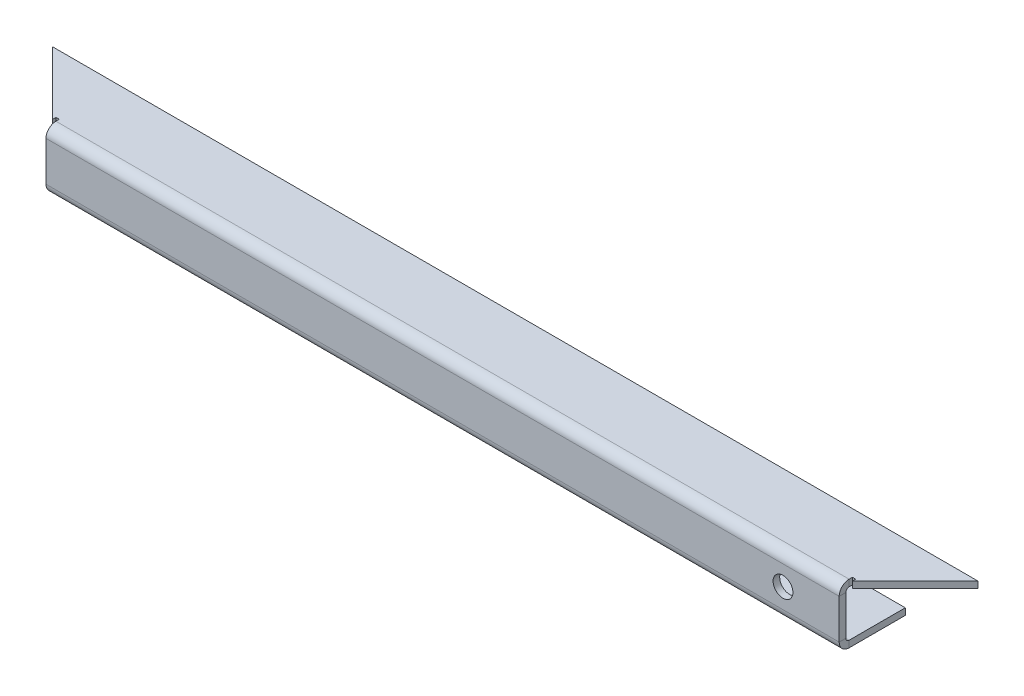
ISO-10303-21;
HEADER;
FILE_DESCRIPTION(('STEP AP214'),'2;1');
FILE_NAME('part.step','',(''),(''),'','','');
FILE_SCHEMA(('AUTOMOTIVE_DESIGN { 1 0 10303 214 1 1 1 1 }'));
ENDSEC;
DATA;
#1=APPLICATION_CONTEXT('core data for automotive mechanical design processes');
#2=APPLICATION_PROTOCOL_DEFINITION('international standard','automotive_design',2000,#1);
#3=PRODUCT_CONTEXT('',#1,'mechanical');
#4=PRODUCT('Part','Part','',(#3));
#5=PRODUCT_RELATED_PRODUCT_CATEGORY('part','',(#4));
#6=PRODUCT_DEFINITION_FORMATION('','',#4);
#7=PRODUCT_DEFINITION_CONTEXT('part definition',#1,'design');
#8=PRODUCT_DEFINITION('design','',#6,#7);
#9=PRODUCT_DEFINITION_SHAPE('','',#8);
#10=(LENGTH_UNIT() NAMED_UNIT(*) SI_UNIT(.MILLI.,.METRE.));
#11=(NAMED_UNIT(*) PLANE_ANGLE_UNIT() SI_UNIT($,.RADIAN.));
#12=(NAMED_UNIT(*) SI_UNIT($,.STERADIAN.) SOLID_ANGLE_UNIT());
#13=UNCERTAINTY_MEASURE_WITH_UNIT(LENGTH_MEASURE(1.E-05),#10,'distance_accuracy_value','');
#14=(GEOMETRIC_REPRESENTATION_CONTEXT(3) GLOBAL_UNCERTAINTY_ASSIGNED_CONTEXT((#13)) GLOBAL_UNIT_ASSIGNED_CONTEXT((#10,
#11,#12)) REPRESENTATION_CONTEXT('',''));
#15=CARTESIAN_POINT('',(0.,0.,0.));
#16=DIRECTION('',(0.,0.,1.));
#17=DIRECTION('',(1.,0.,0.));
#18=AXIS2_PLACEMENT_3D('',#15,#16,#17);
#19=CARTESIAN_POINT('',(-60.,-8.,1.00000000000002));
#20=DIRECTION('',(1.,0.,0.));
#21=DIRECTION('',(0.,0.,-1.));
#22=AXIS2_PLACEMENT_3D('',#19,#20,#21);
#23=PLANE('',#22);
#24=DIRECTION('',(0.,0.,1.));
#25=VECTOR('',#24,1.);
#26=CARTESIAN_POINT('',(-60.,-7.50000000000001,0.));
#27=LINE('',#26,#25);
#28=CARTESIAN_POINT('',(-60.,-7.50000000000001,0.));
#29=VERTEX_POINT('',#28);
#30=CARTESIAN_POINT('',(-60.,-7.5,1.00000000000002));
#31=VERTEX_POINT('',#30);
#32=EDGE_CURVE('E222',#29,#31,#27,.T.);
#33=ORIENTED_EDGE('',*,*,#32,.T.);
#34=DIRECTION('',(0.,-1.,0.));
#35=VECTOR('',#34,1.);
#36=CARTESIAN_POINT('',(-60.,-8.,1.00000000000002));
#37=LINE('',#36,#35);
#38=CARTESIAN_POINT('',(-60.,-1.5,0.999999999999991));
#39=VERTEX_POINT('',#38);
#40=EDGE_CURVE('E245',#39,#31,#37,.T.);
#41=ORIENTED_EDGE('',*,*,#40,.F.);
#42=DIRECTION('',(0.,0.,1.));
#43=VECTOR('',#42,1.);
#44=CARTESIAN_POINT('',(-60.,-1.5,0.));
#45=LINE('',#44,#43);
#46=CARTESIAN_POINT('',(-60.,-1.5,0.));
#47=VERTEX_POINT('',#46);
#48=EDGE_CURVE('E236',#47,#39,#45,.T.);
#49=ORIENTED_EDGE('',*,*,#48,.F.);
#50=DIRECTION('',(0.,-1.,0.));
#51=VECTOR('',#50,1.);
#52=CARTESIAN_POINT('',(-60.,-8.,0.));
#53=LINE('',#52,#51);
#54=EDGE_CURVE('E244',#47,#29,#53,.T.);
#55=ORIENTED_EDGE('',*,*,#54,.T.);
#56=EDGE_LOOP('',(#33,#41,#49,#55));
#57=FACE_BOUND('',#56,.T.);
#58=ADVANCED_FACE('F39',(#57),#23,.F.);
#59=CARTESIAN_POINT('',(60.,-0.999999999999997,0.999999999999978));
#60=DIRECTION('',(-1.,0.,0.));
#61=DIRECTION('',(0.,0.,1.));
#62=AXIS2_PLACEMENT_3D('',#59,#60,#61);
#63=PLANE('',#62);
#64=DIRECTION('',(0.,0.,1.));
#65=VECTOR('',#64,1.);
#66=CARTESIAN_POINT('',(60.,-7.50000000000001,0.));
#67=LINE('',#66,#65);
#68=CARTESIAN_POINT('',(60.,-7.50000000000001,0.));
#69=VERTEX_POINT('',#68);
#70=CARTESIAN_POINT('',(60.,-7.50000000000001,1.));
#71=VERTEX_POINT('',#70);
#72=EDGE_CURVE('E228',#69,#71,#67,.T.);
#73=ORIENTED_EDGE('',*,*,#72,.F.);
#74=DIRECTION('',(0.,1.,0.));
#75=VECTOR('',#74,1.);
#76=CARTESIAN_POINT('',(60.,-1.,0.));
#77=LINE('',#76,#75);
#78=CARTESIAN_POINT('',(60.,-1.5,0.));
#79=VERTEX_POINT('',#78);
#80=EDGE_CURVE('E248',#69,#79,#77,.T.);
#81=ORIENTED_EDGE('',*,*,#80,.T.);
#82=DIRECTION('',(0.,0.,1.));
#83=VECTOR('',#82,1.);
#84=CARTESIAN_POINT('',(60.,-1.5,0.));
#85=LINE('',#84,#83);
#86=CARTESIAN_POINT('',(60.,-1.5,0.99999999999998));
#87=VERTEX_POINT('',#86);
#88=EDGE_CURVE('E231',#79,#87,#85,.T.);
#89=ORIENTED_EDGE('',*,*,#88,.T.);
#90=DIRECTION('',(0.,1.,0.));
#91=VECTOR('',#90,1.);
#92=CARTESIAN_POINT('',(60.,-0.999999999999997,0.999999999999978));
#93=LINE('',#92,#91);
#94=EDGE_CURVE('E247',#71,#87,#93,.T.);
#95=ORIENTED_EDGE('',*,*,#94,.F.);
#96=EDGE_LOOP('',(#73,#81,#89,#95));
#97=FACE_BOUND('',#96,.T.);
#98=ADVANCED_FACE('F389',(#97),#63,.F.);
#99=CARTESIAN_POINT('',(0.,0.,0.999999999999985));
#100=DIRECTION('',(0.,0.,-1.));
#101=DIRECTION('',(0.,1.,0.));
#102=AXIS2_PLACEMENT_3D('',#99,#100,#101);
#103=PLANE('',#102);
#104=CARTESIAN_POINT('',(51.5,-4.49999999999996,0.999999999999991));
#105=DIRECTION('',(0.,0.,-1.));
#106=DIRECTION('',(0.,1.,0.));
#107=AXIS2_PLACEMENT_3D('',#104,#105,#106);
#108=CIRCLE('',#107,1.5);
#109=CARTESIAN_POINT('',(51.5,-2.99999999999996,0.999999999999986));
#110=VERTEX_POINT('',#109);
#111=EDGE_CURVE('E361',#110,#110,#108,.T.);
#112=ORIENTED_EDGE('',*,*,#111,.T.);
#113=EDGE_LOOP('',(#112));
#114=FACE_BOUND('',#113,.T.);
#115=DIRECTION('',(-1.,0.,0.));
#116=VECTOR('',#115,1.);
#117=CARTESIAN_POINT('',(-60.,-7.5,1.00000000000002));
#118=LINE('',#117,#116);
#119=EDGE_CURVE('E175',#31,#71,#118,.F.);
#120=ORIENTED_EDGE('',*,*,#119,.T.);
#121=ORIENTED_EDGE('',*,*,#94,.T.);
#122=DIRECTION('',(1.,0.,0.));
#123=VECTOR('',#122,1.);
#124=CARTESIAN_POINT('',(0.,-1.5,0.999999999999991));
#125=LINE('',#124,#123);
#126=EDGE_CURVE('E239',#39,#87,#125,.T.);
#127=ORIENTED_EDGE('',*,*,#126,.F.);
#128=ORIENTED_EDGE('',*,*,#40,.T.);
#129=EDGE_LOOP('',(#120,#121,#127,#128));
#130=FACE_BOUND('',#129,.T.);
#131=ADVANCED_FACE('F377',(#114,#130),#103,.F.);
#132=CARTESIAN_POINT('',(0.,0.,0.));
#133=DIRECTION('',(0.,0.,-1.));
#134=DIRECTION('',(0.,1.,0.));
#135=AXIS2_PLACEMENT_3D('',#132,#133,#134);
#136=PLANE('',#135);
#137=CARTESIAN_POINT('',(51.5,-4.49999999999997,0.));
#138=DIRECTION('',(0.,0.,-1.));
#139=DIRECTION('',(0.,1.,0.));
#140=AXIS2_PLACEMENT_3D('',#137,#138,#139);
#141=CIRCLE('',#140,1.5);
#142=CARTESIAN_POINT('',(51.5,-2.99999999999996,0.));
#143=VERTEX_POINT('',#142);
#144=EDGE_CURVE('E368',#143,#143,#141,.T.);
#145=ORIENTED_EDGE('',*,*,#144,.F.);
#146=EDGE_LOOP('',(#145));
#147=FACE_BOUND('',#146,.T.);
#148=ORIENTED_EDGE('',*,*,#80,.F.);
#149=DIRECTION('',(-1.,0.,0.));
#150=VECTOR('',#149,1.);
#151=CARTESIAN_POINT('',(-60.,-7.50000000000001,0.));
#152=LINE('',#151,#150);
#153=EDGE_CURVE('E56',#29,#69,#152,.F.);
#154=ORIENTED_EDGE('',*,*,#153,.F.);
#155=ORIENTED_EDGE('',*,*,#54,.F.);
#156=DIRECTION('',(-1.,0.,0.));
#157=VECTOR('',#156,1.);
#158=CARTESIAN_POINT('',(60.,-1.5,0.));
#159=LINE('',#158,#157);
#160=EDGE_CURVE('E234',#79,#47,#159,.T.);
#161=ORIENTED_EDGE('',*,*,#160,.F.);
#162=EDGE_LOOP('',(#148,#154,#155,#161));
#163=FACE_BOUND('',#162,.T.);
#164=ADVANCED_FACE('F375',(#147,#163),#136,.T.);
#165=CARTESIAN_POINT('',(-60.,-1.,0.));
#166=DIRECTION('',(-0.707106781186544,0.,0.707106781186552));
#167=DIRECTION('',(0.707106781186552,0.,0.707106781186544));
#168=AXIS2_PLACEMENT_3D('',#165,#166,#167);
#169=PLANE('',#168);
#170=DIRECTION('',(0.707106781186552,0.,0.707106781186544));
#171=VECTOR('',#170,1.);
#172=CARTESIAN_POINT('',(-60.,-1.,0.));
#173=LINE('',#172,#171);
#174=CARTESIAN_POINT('',(-70.0000000000001,-1.,-10.));
#175=VERTEX_POINT('',#174);
#176=CARTESIAN_POINT('',(-60.5,-1.,-0.499999999999981));
#177=VERTEX_POINT('',#176);
#178=EDGE_CURVE('E308',#175,#177,#173,.T.);
#179=ORIENTED_EDGE('',*,*,#178,.T.);
#180=DIRECTION('',(0.,1.,0.));
#181=VECTOR('',#180,1.);
#182=CARTESIAN_POINT('',(-60.5,-0.999999999999999,-0.499999999999981));
#183=LINE('',#182,#181);
#184=CARTESIAN_POINT('',(-60.5,0.,-0.499999999999981));
#185=VERTEX_POINT('',#184);
#186=EDGE_CURVE('E279',#177,#185,#183,.T.);
#187=ORIENTED_EDGE('',*,*,#186,.T.);
#188=DIRECTION('',(0.707106781186552,0.,0.707106781186544));
#189=VECTOR('',#188,1.);
#190=CARTESIAN_POINT('',(-60.,0.,0.));
#191=LINE('',#190,#189);
#192=CARTESIAN_POINT('',(-70.0000000000001,0.,-10.));
#193=VERTEX_POINT('',#192);
#194=EDGE_CURVE('E278',#193,#185,#191,.T.);
#195=ORIENTED_EDGE('',*,*,#194,.F.);
#196=DIRECTION('',(0.,1.,0.));
#197=VECTOR('',#196,1.);
#198=CARTESIAN_POINT('',(-70.0000000000001,-1.,-10.));
#199=LINE('',#198,#197);
#200=EDGE_CURVE('E324',#175,#193,#199,.T.);
#201=ORIENTED_EDGE('',*,*,#200,.F.);
#202=EDGE_LOOP('',(#179,#187,#195,#201));
#203=FACE_BOUND('',#202,.T.);
#204=ADVANCED_FACE('F41',(#203),#169,.T.);
#205=CARTESIAN_POINT('',(60.,-1.,0.));
#206=DIRECTION('',(0.707106781186544,0.,0.707106781186552));
#207=DIRECTION('',(0.707106781186551,0.,-0.707106781186544));
#208=AXIS2_PLACEMENT_3D('',#205,#206,#207);
#209=PLANE('',#208);
#210=DIRECTION('',(0.707106781186551,0.,-0.707106781186544));
#211=VECTOR('',#210,1.);
#212=CARTESIAN_POINT('',(60.,0.,0.));
#213=LINE('',#212,#211);
#214=CARTESIAN_POINT('',(60.5,0.,-0.500000000000003));
#215=VERTEX_POINT('',#214);
#216=CARTESIAN_POINT('',(70.0000000000001,0.,-10.));
#217=VERTEX_POINT('',#216);
#218=EDGE_CURVE('E320',#215,#217,#213,.T.);
#219=ORIENTED_EDGE('',*,*,#218,.F.);
#220=DIRECTION('',(0.,1.,0.));
#221=VECTOR('',#220,1.);
#222=CARTESIAN_POINT('',(60.5,-0.999999999999999,-0.500000000000003));
#223=LINE('',#222,#221);
#224=CARTESIAN_POINT('',(60.5,-1.,-0.500000000000003));
#225=VERTEX_POINT('',#224);
#226=EDGE_CURVE('E296',#225,#215,#223,.T.);
#227=ORIENTED_EDGE('',*,*,#226,.F.);
#228=DIRECTION('',(0.707106781186551,0.,-0.707106781186544));
#229=VECTOR('',#228,1.);
#230=CARTESIAN_POINT('',(60.,-1.,0.));
#231=LINE('',#230,#229);
#232=CARTESIAN_POINT('',(70.0000000000001,-1.,-10.));
#233=VERTEX_POINT('',#232);
#234=EDGE_CURVE('E311',#225,#233,#231,.T.);
#235=ORIENTED_EDGE('',*,*,#234,.T.);
#236=DIRECTION('',(0.,1.,0.));
#237=VECTOR('',#236,1.);
#238=CARTESIAN_POINT('',(70.0000000000001,-1.,-10.));
#239=LINE('',#238,#237);
#240=EDGE_CURVE('E317',#233,#217,#239,.T.);
#241=ORIENTED_EDGE('',*,*,#240,.T.);
#242=EDGE_LOOP('',(#219,#227,#235,#241));
#243=FACE_BOUND('',#242,.T.);
#244=ADVANCED_FACE('F455',(#243),#209,.T.);
#245=CARTESIAN_POINT('',(0.,-1.,0.));
#246=DIRECTION('',(0.,-1.,0.));
#247=DIRECTION('',(0.,0.,-1.));
#248=AXIS2_PLACEMENT_3D('',#245,#246,#247);
#249=PLANE('',#248);
#250=DIRECTION('',(1.,0.,0.));
#251=VECTOR('',#250,1.);
#252=CARTESIAN_POINT('',(-60.5,-0.999999999999999,-0.999999999999998));
#253=LINE('',#252,#251);
#254=CARTESIAN_POINT('',(-60.5,-1.,-0.999999999999998));
#255=VERTEX_POINT('',#254);
#256=CARTESIAN_POINT('',(-60.,-1.,-0.999999999999998));
#257=VERTEX_POINT('',#256);
#258=EDGE_CURVE('E64',#255,#257,#253,.T.);
#259=ORIENTED_EDGE('',*,*,#258,.F.);
#260=DIRECTION('',(0.,0.,-1.));
#261=VECTOR('',#260,1.);
#262=CARTESIAN_POINT('',(-60.5,-0.999999999999999,-0.499999999999981));
#263=LINE('',#262,#261);
#264=EDGE_CURVE('E275',#177,#255,#263,.T.);
#265=ORIENTED_EDGE('',*,*,#264,.F.);
#266=ORIENTED_EDGE('',*,*,#178,.F.);
#267=DIRECTION('',(-1.,0.,0.));
#268=VECTOR('',#267,1.);
#269=CARTESIAN_POINT('',(-70.0000000000001,-1.,-10.));
#270=LINE('',#269,#268);
#271=EDGE_CURVE('E314',#233,#175,#270,.T.);
#272=ORIENTED_EDGE('',*,*,#271,.F.);
#273=ORIENTED_EDGE('',*,*,#234,.F.);
#274=DIRECTION('',(0.,0.,1.));
#275=VECTOR('',#274,1.);
#276=CARTESIAN_POINT('',(60.5,-0.999999999999999,-1.00000000000002));
#277=LINE('',#276,#275);
#278=CARTESIAN_POINT('',(60.5,-1.,-1.00000000000002));
#279=VERTEX_POINT('',#278);
#280=EDGE_CURVE('E293',#279,#225,#277,.T.);
#281=ORIENTED_EDGE('',*,*,#280,.F.);
#282=DIRECTION('',(1.,0.,0.));
#283=VECTOR('',#282,1.);
#284=CARTESIAN_POINT('',(60.,-0.999999999999999,-1.00000000000002));
#285=LINE('',#284,#283);
#286=CARTESIAN_POINT('',(60.,-1.,-1.00000000000002));
#287=VERTEX_POINT('',#286);
#288=EDGE_CURVE('E289',#287,#279,#285,.T.);
#289=ORIENTED_EDGE('',*,*,#288,.F.);
#290=DIRECTION('',(0.,0.,-1.));
#291=VECTOR('',#290,1.);
#292=CARTESIAN_POINT('',(60.,-0.999999999999999,-0.500000000000024));
#293=LINE('',#292,#291);
#294=CARTESIAN_POINT('',(60.,-1.,-0.500000000000024));
#295=VERTEX_POINT('',#294);
#296=EDGE_CURVE('E286',#295,#287,#293,.T.);
#297=ORIENTED_EDGE('',*,*,#296,.F.);
#298=DIRECTION('',(-1.,0.,0.));
#299=VECTOR('',#298,1.);
#300=CARTESIAN_POINT('',(-60.,-0.999999999999999,-0.499999999999998));
#301=LINE('',#300,#299);
#302=CARTESIAN_POINT('',(-60.,-1.,-0.499999999999998));
#303=VERTEX_POINT('',#302);
#304=EDGE_CURVE('E265',#303,#295,#301,.F.);
#305=ORIENTED_EDGE('',*,*,#304,.F.);
#306=DIRECTION('',(0.,0.,1.));
#307=VECTOR('',#306,1.);
#308=CARTESIAN_POINT('',(-60.,-0.999999999999999,-0.999999999999998));
#309=LINE('',#308,#307);
#310=EDGE_CURVE('E282',#257,#303,#309,.T.);
#311=ORIENTED_EDGE('',*,*,#310,.F.);
#312=EDGE_LOOP('',(#259,#265,#266,#272,#273,#281,#289,#297,#305,#311));
#313=FACE_BOUND('',#312,.T.);
#314=ADVANCED_FACE('F406',(#313),#249,.T.);
#315=CARTESIAN_POINT('',(0.,0.,0.));
#316=DIRECTION('',(0.,-1.,0.));
#317=DIRECTION('',(0.,0.,-1.));
#318=AXIS2_PLACEMENT_3D('',#315,#316,#317);
#319=PLANE('',#318);
#320=DIRECTION('',(0.,0.,1.));
#321=VECTOR('',#320,1.);
#322=CARTESIAN_POINT('',(-60.5,0.,0.));
#323=LINE('',#322,#321);
#324=CARTESIAN_POINT('',(-60.5,0.,-0.999999999999998));
#325=VERTEX_POINT('',#324);
#326=EDGE_CURVE('E11',#325,#185,#323,.T.);
#327=ORIENTED_EDGE('',*,*,#326,.F.);
#328=DIRECTION('',(-1.,0.,0.));
#329=VECTOR('',#328,1.);
#330=CARTESIAN_POINT('',(0.,0.,-0.999999999999998));
#331=LINE('',#330,#329);
#332=CARTESIAN_POINT('',(-60.,0.,-0.999999999999998));
#333=VERTEX_POINT('',#332);
#334=EDGE_CURVE('E48',#333,#325,#331,.T.);
#335=ORIENTED_EDGE('',*,*,#334,.F.);
#336=DIRECTION('',(0.,0.,-1.));
#337=VECTOR('',#336,1.);
#338=CARTESIAN_POINT('',(-60.,0.,0.));
#339=LINE('',#338,#337);
#340=CARTESIAN_POINT('',(-60.,0.,-0.500000000000002));
#341=VERTEX_POINT('',#340);
#342=EDGE_CURVE('E337',#341,#333,#339,.T.);
#343=ORIENTED_EDGE('',*,*,#342,.F.);
#344=DIRECTION('',(-1.,0.,0.));
#345=VECTOR('',#344,1.);
#346=CARTESIAN_POINT('',(-60.,0.,-0.500000000000002));
#347=LINE('',#346,#345);
#348=CARTESIAN_POINT('',(60.,0.,-0.500000000000024));
#349=VERTEX_POINT('',#348);
#350=EDGE_CURVE('E253',#341,#349,#347,.F.);
#351=ORIENTED_EDGE('',*,*,#350,.T.);
#352=DIRECTION('',(0.,0.,1.));
#353=VECTOR('',#352,1.);
#354=CARTESIAN_POINT('',(60.,0.,0.));
#355=LINE('',#354,#353);
#356=CARTESIAN_POINT('',(60.,0.,-1.00000000000002));
#357=VERTEX_POINT('',#356);
#358=EDGE_CURVE('E334',#357,#349,#355,.T.);
#359=ORIENTED_EDGE('',*,*,#358,.F.);
#360=DIRECTION('',(-1.,0.,0.));
#361=VECTOR('',#360,1.);
#362=CARTESIAN_POINT('',(0.,0.,-1.00000000000002));
#363=LINE('',#362,#361);
#364=CARTESIAN_POINT('',(60.5,0.,-1.00000000000002));
#365=VERTEX_POINT('',#364);
#366=EDGE_CURVE('E331',#365,#357,#363,.T.);
#367=ORIENTED_EDGE('',*,*,#366,.F.);
#368=DIRECTION('',(0.,0.,-1.));
#369=VECTOR('',#368,1.);
#370=CARTESIAN_POINT('',(60.5,0.,0.));
#371=LINE('',#370,#369);
#372=EDGE_CURVE('E326',#215,#365,#371,.T.);
#373=ORIENTED_EDGE('',*,*,#372,.F.);
#374=ORIENTED_EDGE('',*,*,#218,.T.);
#375=DIRECTION('',(-1.,0.,0.));
#376=VECTOR('',#375,1.);
#377=CARTESIAN_POINT('',(-70.0000000000001,0.,-10.));
#378=LINE('',#377,#376);
#379=EDGE_CURVE('E312',#217,#193,#378,.T.);
#380=ORIENTED_EDGE('',*,*,#379,.T.);
#381=ORIENTED_EDGE('',*,*,#194,.T.);
#382=EDGE_LOOP('',(#327,#335,#343,#351,#359,#367,#373,#374,#380,#381));
#383=FACE_BOUND('',#382,.T.);
#384=ADVANCED_FACE('F454',(#383),#319,.F.);
#385=CARTESIAN_POINT('',(-70.0000000000001,-1.,-10.));
#386=DIRECTION('',(0.,0.,-1.));
#387=DIRECTION('',(-1.,0.,0.));
#388=AXIS2_PLACEMENT_3D('',#385,#386,#387);
#389=PLANE('',#388);
#390=ORIENTED_EDGE('',*,*,#379,.F.);
#391=ORIENTED_EDGE('',*,*,#240,.F.);
#392=ORIENTED_EDGE('',*,*,#271,.T.);
#393=ORIENTED_EDGE('',*,*,#200,.T.);
#394=EDGE_LOOP('',(#390,#391,#392,#393));
#395=FACE_BOUND('',#394,.T.);
#396=ADVANCED_FACE('F450',(#395),#389,.T.);
#397=CARTESIAN_POINT('',(-60.5,-0.999999999999999,-0.499999999999981));
#398=DIRECTION('',(1.,0.,0.));
#399=DIRECTION('',(0.,0.,-1.));
#400=AXIS2_PLACEMENT_3D('',#397,#398,#399);
#401=PLANE('',#400);
#402=DIRECTION('',(0.,1.,0.));
#403=VECTOR('',#402,1.);
#404=CARTESIAN_POINT('',(-60.5,-0.999999999999999,-0.999999999999998));
#405=LINE('',#404,#403);
#406=EDGE_CURVE('E281',#255,#325,#405,.T.);
#407=ORIENTED_EDGE('',*,*,#406,.T.);
#408=ORIENTED_EDGE('',*,*,#326,.T.);
#409=ORIENTED_EDGE('',*,*,#186,.F.);
#410=ORIENTED_EDGE('',*,*,#264,.T.);
#411=EDGE_LOOP('',(#407,#408,#409,#410));
#412=FACE_BOUND('',#411,.T.);
#413=ADVANCED_FACE('F446',(#412),#401,.T.);
#414=CARTESIAN_POINT('',(-60.5,-0.999999999999999,-0.999999999999998));
#415=DIRECTION('',(0.,0.,1.));
#416=DIRECTION('',(0.,-1.,0.));
#417=AXIS2_PLACEMENT_3D('',#414,#415,#416);
#418=PLANE('',#417);
#419=DIRECTION('',(0.,1.,0.));
#420=VECTOR('',#419,1.);
#421=CARTESIAN_POINT('',(-60.,-0.999999999999999,-0.999999999999998));
#422=LINE('',#421,#420);
#423=EDGE_CURVE('E285',#257,#333,#422,.T.);
#424=ORIENTED_EDGE('',*,*,#423,.T.);
#425=ORIENTED_EDGE('',*,*,#334,.T.);
#426=ORIENTED_EDGE('',*,*,#406,.F.);
#427=ORIENTED_EDGE('',*,*,#258,.T.);
#428=EDGE_LOOP('',(#424,#425,#426,#427));
#429=FACE_BOUND('',#428,.T.);
#430=ADVANCED_FACE('F443',(#429),#418,.T.);
#431=CARTESIAN_POINT('',(-60.,-0.999999999999999,-0.999999999999998));
#432=DIRECTION('',(-1.,0.,0.));
#433=DIRECTION('',(0.,0.,1.));
#434=AXIS2_PLACEMENT_3D('',#431,#432,#433);
#435=PLANE('',#434);
#436=DIRECTION('',(0.,1.,0.));
#437=VECTOR('',#436,1.);
#438=CARTESIAN_POINT('',(-60.,-0.999999999999999,-0.499999999999998));
#439=LINE('',#438,#437);
#440=EDGE_CURVE('E259',#303,#341,#439,.T.);
#441=ORIENTED_EDGE('',*,*,#440,.T.);
#442=ORIENTED_EDGE('',*,*,#342,.T.);
#443=ORIENTED_EDGE('',*,*,#423,.F.);
#444=ORIENTED_EDGE('',*,*,#310,.T.);
#445=EDGE_LOOP('',(#441,#442,#443,#444));
#446=FACE_BOUND('',#445,.T.);
#447=ADVANCED_FACE('F410',(#446),#435,.T.);
#448=CARTESIAN_POINT('',(60.,-0.999999999999999,-0.500000000000024));
#449=DIRECTION('',(1.,0.,0.));
#450=DIRECTION('',(0.,0.,-1.));
#451=AXIS2_PLACEMENT_3D('',#448,#449,#450);
#452=PLANE('',#451);
#453=DIRECTION('',(0.,1.,0.));
#454=VECTOR('',#453,1.);
#455=CARTESIAN_POINT('',(60.,-0.999999999999999,-1.00000000000002));
#456=LINE('',#455,#454);
#457=EDGE_CURVE('E292',#287,#357,#456,.T.);
#458=ORIENTED_EDGE('',*,*,#457,.T.);
#459=ORIENTED_EDGE('',*,*,#358,.T.);
#460=DIRECTION('',(0.,1.,0.));
#461=VECTOR('',#460,1.);
#462=CARTESIAN_POINT('',(60.,-0.999999999999999,-0.500000000000024));
#463=LINE('',#462,#461);
#464=EDGE_CURVE('E270',#295,#349,#463,.T.);
#465=ORIENTED_EDGE('',*,*,#464,.F.);
#466=ORIENTED_EDGE('',*,*,#296,.T.);
#467=EDGE_LOOP('',(#458,#459,#465,#466));
#468=FACE_BOUND('',#467,.T.);
#469=ADVANCED_FACE('F402',(#468),#452,.T.);
#470=CARTESIAN_POINT('',(60.,-0.999999999999999,-1.00000000000002));
#471=DIRECTION('',(0.,0.,1.));
#472=DIRECTION('',(0.,-1.,0.));
#473=AXIS2_PLACEMENT_3D('',#470,#471,#472);
#474=PLANE('',#473);
#475=DIRECTION('',(0.,1.,0.));
#476=VECTOR('',#475,1.);
#477=CARTESIAN_POINT('',(60.5,-0.999999999999999,-1.00000000000002));
#478=LINE('',#477,#476);
#479=EDGE_CURVE('E273',#279,#365,#478,.T.);
#480=ORIENTED_EDGE('',*,*,#479,.T.);
#481=ORIENTED_EDGE('',*,*,#366,.T.);
#482=ORIENTED_EDGE('',*,*,#457,.F.);
#483=ORIENTED_EDGE('',*,*,#288,.T.);
#484=EDGE_LOOP('',(#480,#481,#482,#483));
#485=FACE_BOUND('',#484,.T.);
#486=ADVANCED_FACE('F434',(#485),#474,.T.);
#487=CARTESIAN_POINT('',(60.5,-0.999999999999999,-1.00000000000002));
#488=DIRECTION('',(-1.,0.,0.));
#489=DIRECTION('',(0.,0.,1.));
#490=AXIS2_PLACEMENT_3D('',#487,#488,#489);
#491=PLANE('',#490);
#492=ORIENTED_EDGE('',*,*,#226,.T.);
#493=ORIENTED_EDGE('',*,*,#372,.T.);
#494=ORIENTED_EDGE('',*,*,#479,.F.);
#495=ORIENTED_EDGE('',*,*,#280,.T.);
#496=EDGE_LOOP('',(#492,#493,#494,#495));
#497=FACE_BOUND('',#496,.T.);
#498=ADVANCED_FACE('F429',(#497),#491,.T.);
#499=CARTESIAN_POINT('',(60.,-1.5,-0.500000000000022));
#500=DIRECTION('',(1.,0.,0.));
#501=DIRECTION('',(0.,0.,-1.));
#502=AXIS2_PLACEMENT_3D('',#499,#500,#501);
#503=PLANE('',#502);
#504=ORIENTED_EDGE('',*,*,#88,.F.);
#505=CARTESIAN_POINT('',(60.,-1.5,-0.500000000000022));
#506=DIRECTION('',(-1.,0.,0.));
#507=DIRECTION('',(0.,0.,1.));
#508=AXIS2_PLACEMENT_3D('',#505,#506,#507);
#509=CIRCLE('',#508,0.500000000000002);
#510=EDGE_CURVE('E262',#295,#79,#509,.F.);
#511=ORIENTED_EDGE('',*,*,#510,.F.);
#512=ORIENTED_EDGE('',*,*,#464,.T.);
#513=CARTESIAN_POINT('',(60.,-1.5,-0.500000000000022));
#514=DIRECTION('',(-1.,0.,0.));
#515=DIRECTION('',(0.,0.,1.));
#516=AXIS2_PLACEMENT_3D('',#513,#514,#515);
#517=CIRCLE('',#516,1.5);
#518=EDGE_CURVE('E255',#349,#87,#517,.F.);
#519=ORIENTED_EDGE('',*,*,#518,.T.);
#520=EDGE_LOOP('',(#504,#511,#512,#519));
#521=FACE_BOUND('',#520,.T.);
#522=ADVANCED_FACE('F398',(#521),#503,.T.);
#523=CARTESIAN_POINT('',(-60.,-1.5,-0.499999999999996));
#524=DIRECTION('',(1.,0.,0.));
#525=DIRECTION('',(0.,0.,-1.));
#526=AXIS2_PLACEMENT_3D('',#523,#524,#525);
#527=PLANE('',#526);
#528=CARTESIAN_POINT('',(-60.,-1.5,-0.499999999999996));
#529=DIRECTION('',(-1.,0.,0.));
#530=DIRECTION('',(0.,0.,1.));
#531=AXIS2_PLACEMENT_3D('',#528,#529,#530);
#532=CIRCLE('',#531,0.500000000000002);
#533=EDGE_CURVE('E250',#47,#303,#532,.T.);
#534=ORIENTED_EDGE('',*,*,#533,.F.);
#535=ORIENTED_EDGE('',*,*,#48,.T.);
#536=CARTESIAN_POINT('',(-60.,-1.5,-0.499999999999996));
#537=DIRECTION('',(-1.,0.,0.));
#538=DIRECTION('',(0.,0.,1.));
#539=AXIS2_PLACEMENT_3D('',#536,#537,#538);
#540=CIRCLE('',#539,1.5);
#541=EDGE_CURVE('E256',#39,#341,#540,.T.);
#542=ORIENTED_EDGE('',*,*,#541,.T.);
#543=ORIENTED_EDGE('',*,*,#440,.F.);
#544=EDGE_LOOP('',(#534,#535,#542,#543));
#545=FACE_BOUND('',#544,.T.);
#546=ADVANCED_FACE('F413',(#545),#527,.F.);
#547=CARTESIAN_POINT('',(-60.,-1.5,-0.499999999999996));
#548=DIRECTION('',(-1.,0.,0.));
#549=DIRECTION('',(0.,0.,1.));
#550=AXIS2_PLACEMENT_3D('',#547,#548,#549);
#551=CYLINDRICAL_SURFACE('',#550,1.5);
#552=ORIENTED_EDGE('',*,*,#350,.F.);
#553=ORIENTED_EDGE('',*,*,#541,.F.);
#554=ORIENTED_EDGE('',*,*,#126,.T.);
#555=ORIENTED_EDGE('',*,*,#518,.F.);
#556=EDGE_LOOP('',(#552,#553,#554,#555));
#557=FACE_BOUND('',#556,.T.);
#558=ADVANCED_FACE('F396',(#557),#551,.T.);
#559=CARTESIAN_POINT('',(-60.,-1.5,-0.499999999999996));
#560=DIRECTION('',(-1.,0.,0.));
#561=DIRECTION('',(0.,0.,1.));
#562=AXIS2_PLACEMENT_3D('',#559,#560,#561);
#563=CYLINDRICAL_SURFACE('',#562,0.500000000000002);
#564=ORIENTED_EDGE('',*,*,#304,.T.);
#565=ORIENTED_EDGE('',*,*,#510,.T.);
#566=ORIENTED_EDGE('',*,*,#160,.T.);
#567=ORIENTED_EDGE('',*,*,#533,.T.);
#568=EDGE_LOOP('',(#564,#565,#566,#567));
#569=FACE_BOUND('',#568,.T.);
#570=ADVANCED_FACE('F404',(#569),#563,.F.);
#571=CARTESIAN_POINT('',(60.,-7.50000000000001,-0.500000000000003));
#572=DIRECTION('',(1.,0.,0.));
#573=DIRECTION('',(0.,0.,-1.));
#574=AXIS2_PLACEMENT_3D('',#571,#572,#573);
#575=PLANE('',#574);
#576=DIRECTION('',(0.,-1.,0.));
#577=VECTOR('',#576,1.);
#578=CARTESIAN_POINT('',(60.,-8.00000000000001,-0.499999999999998));
#579=LINE('',#578,#577);
#580=CARTESIAN_POINT('',(60.,-8.00000000000001,-0.5));
#581=VERTEX_POINT('',#580);
#582=CARTESIAN_POINT('',(60.,-9.00000000000001,-0.499999999999993));
#583=VERTEX_POINT('',#582);
#584=EDGE_CURVE('E350',#581,#583,#579,.T.);
#585=ORIENTED_EDGE('',*,*,#584,.F.);
#586=CARTESIAN_POINT('',(60.,-7.50000000000001,-0.500000000000003));
#587=DIRECTION('',(-1.,0.,0.));
#588=DIRECTION('',(0.,0.,1.));
#589=AXIS2_PLACEMENT_3D('',#586,#587,#588);
#590=CIRCLE('',#589,0.5);
#591=EDGE_CURVE('E178',#69,#581,#590,.F.);
#592=ORIENTED_EDGE('',*,*,#591,.F.);
#593=ORIENTED_EDGE('',*,*,#72,.T.);
#594=CARTESIAN_POINT('',(60.,-7.50000000000001,-0.500000000000003));
#595=DIRECTION('',(-1.,0.,0.));
#596=DIRECTION('',(0.,0.,1.));
#597=AXIS2_PLACEMENT_3D('',#594,#595,#596);
#598=CIRCLE('',#597,1.5);
#599=EDGE_CURVE('E221',#71,#583,#598,.F.);
#600=ORIENTED_EDGE('',*,*,#599,.T.);
#601=EDGE_LOOP('',(#585,#592,#593,#600));
#602=FACE_BOUND('',#601,.T.);
#603=ADVANCED_FACE('F387',(#602),#575,.T.);
#604=CARTESIAN_POINT('',(-60.,-7.50000000000001,-0.499999999999977));
#605=DIRECTION('',(1.,0.,0.));
#606=DIRECTION('',(0.,0.,-1.));
#607=AXIS2_PLACEMENT_3D('',#604,#605,#606);
#608=PLANE('',#607);
#609=CARTESIAN_POINT('',(-60.,-7.50000000000001,-0.499999999999977));
#610=DIRECTION('',(-1.,0.,0.));
#611=DIRECTION('',(0.,0.,1.));
#612=AXIS2_PLACEMENT_3D('',#609,#610,#611);
#613=CIRCLE('',#612,0.5);
#614=CARTESIAN_POINT('',(-60.,-8.00000000000001,-0.499999999999974));
#615=VERTEX_POINT('',#614);
#616=EDGE_CURVE('E185',#615,#29,#613,.T.);
#617=ORIENTED_EDGE('',*,*,#616,.F.);
#618=DIRECTION('',(0.,-1.,0.));
#619=VECTOR('',#618,1.);
#620=CARTESIAN_POINT('',(-60.,-8.00000000000001,-0.499999999999975));
#621=LINE('',#620,#619);
#622=CARTESIAN_POINT('',(-60.,-9.00000000000001,-0.499999999999968));
#623=VERTEX_POINT('',#622);
#624=EDGE_CURVE('E182',#615,#623,#621,.T.);
#625=ORIENTED_EDGE('',*,*,#624,.T.);
#626=CARTESIAN_POINT('',(-60.,-7.50000000000001,-0.499999999999977));
#627=DIRECTION('',(-1.,0.,0.));
#628=DIRECTION('',(0.,0.,1.));
#629=AXIS2_PLACEMENT_3D('',#626,#627,#628);
#630=CIRCLE('',#629,1.5);
#631=EDGE_CURVE('E168',#623,#31,#630,.T.);
#632=ORIENTED_EDGE('',*,*,#631,.T.);
#633=ORIENTED_EDGE('',*,*,#32,.F.);
#634=EDGE_LOOP('',(#617,#625,#632,#633));
#635=FACE_BOUND('',#634,.T.);
#636=ADVANCED_FACE('F183',(#635),#608,.F.);
#637=CARTESIAN_POINT('',(-60.,-7.50000000000001,-0.499999999999977));
#638=DIRECTION('',(-1.,0.,0.));
#639=DIRECTION('',(0.,-1.,0.));
#640=AXIS2_PLACEMENT_3D('',#637,#638,#639);
#641=CYLINDRICAL_SURFACE('',#640,1.5);
#642=ORIENTED_EDGE('',*,*,#119,.F.);
#643=ORIENTED_EDGE('',*,*,#631,.F.);
#644=DIRECTION('',(1.,0.,0.));
#645=VECTOR('',#644,1.);
#646=CARTESIAN_POINT('',(0.,-9.00000000000001,-0.49999999999998));
#647=LINE('',#646,#645);
#648=EDGE_CURVE('E173',#623,#583,#647,.T.);
#649=ORIENTED_EDGE('',*,*,#648,.T.);
#650=ORIENTED_EDGE('',*,*,#599,.F.);
#651=EDGE_LOOP('',(#642,#643,#649,#650));
#652=FACE_BOUND('',#651,.T.);
#653=ADVANCED_FACE('F170',(#652),#641,.T.);
#654=CARTESIAN_POINT('',(-60.,-7.50000000000001,-0.499999999999977));
#655=DIRECTION('',(-1.,0.,0.));
#656=DIRECTION('',(0.,-1.,0.));
#657=AXIS2_PLACEMENT_3D('',#654,#655,#656);
#658=CYLINDRICAL_SURFACE('',#657,0.5);
#659=ORIENTED_EDGE('',*,*,#153,.T.);
#660=ORIENTED_EDGE('',*,*,#591,.T.);
#661=DIRECTION('',(-1.,0.,0.));
#662=VECTOR('',#661,1.);
#663=CARTESIAN_POINT('',(60.,-8.00000000000001,-0.499999999999998));
#664=LINE('',#663,#662);
#665=EDGE_CURVE('E189',#581,#615,#664,.T.);
#666=ORIENTED_EDGE('',*,*,#665,.T.);
#667=ORIENTED_EDGE('',*,*,#616,.T.);
#668=EDGE_LOOP('',(#659,#660,#666,#667));
#669=FACE_BOUND('',#668,.T.);
#670=ADVANCED_FACE('F384',(#669),#658,.F.);
#671=CARTESIAN_POINT('',(-60.,-9.00000000000007,-8.99999999999997));
#672=DIRECTION('',(1.,0.,0.));
#673=DIRECTION('',(0.,1.,0.));
#674=AXIS2_PLACEMENT_3D('',#671,#672,#673);
#675=PLANE('',#674);
#676=ORIENTED_EDGE('',*,*,#624,.F.);
#677=DIRECTION('',(0.,0.,-1.));
#678=VECTOR('',#677,1.);
#679=CARTESIAN_POINT('',(-60.,-8.00000000000007,-8.99999999999998));
#680=LINE('',#679,#678);
#681=CARTESIAN_POINT('',(-60.,-8.00000000000007,-8.99999999999998));
#682=VERTEX_POINT('',#681);
#683=EDGE_CURVE('E198',#615,#682,#680,.T.);
#684=ORIENTED_EDGE('',*,*,#683,.T.);
#685=DIRECTION('',(0.,1.,0.));
#686=VECTOR('',#685,1.);
#687=CARTESIAN_POINT('',(-60.,-9.00000000000007,-8.99999999999997));
#688=LINE('',#687,#686);
#689=CARTESIAN_POINT('',(-60.,-9.00000000000007,-8.99999999999997));
#690=VERTEX_POINT('',#689);
#691=EDGE_CURVE('E202',#690,#682,#688,.T.);
#692=ORIENTED_EDGE('',*,*,#691,.F.);
#693=DIRECTION('',(0.,0.,-1.));
#694=VECTOR('',#693,1.);
#695=CARTESIAN_POINT('',(-60.,-9.00000000000007,-8.99999999999997));
#696=LINE('',#695,#694);
#697=EDGE_CURVE('E194',#623,#690,#696,.T.);
#698=ORIENTED_EDGE('',*,*,#697,.F.);
#699=EDGE_LOOP('',(#676,#684,#692,#698));
#700=FACE_BOUND('',#699,.T.);
#701=ADVANCED_FACE('F200',(#700),#675,.F.);
#702=CARTESIAN_POINT('',(60.,-9.00000000000001,0.));
#703=DIRECTION('',(-1.,0.,0.));
#704=DIRECTION('',(0.,-1.,0.));
#705=AXIS2_PLACEMENT_3D('',#702,#703,#704);
#706=PLANE('',#705);
#707=ORIENTED_EDGE('',*,*,#584,.T.);
#708=DIRECTION('',(0.,0.,1.));
#709=VECTOR('',#708,1.);
#710=CARTESIAN_POINT('',(60.,-9.00000000000001,0.));
#711=LINE('',#710,#709);
#712=CARTESIAN_POINT('',(60.,-9.00000000000007,-8.99999999999999));
#713=VERTEX_POINT('',#712);
#714=EDGE_CURVE('E197',#713,#583,#711,.T.);
#715=ORIENTED_EDGE('',*,*,#714,.F.);
#716=DIRECTION('',(0.,1.,0.));
#717=VECTOR('',#716,1.);
#718=CARTESIAN_POINT('',(60.,-9.00000000000007,-8.99999999999999));
#719=LINE('',#718,#717);
#720=CARTESIAN_POINT('',(60.,-8.00000000000007,-9.));
#721=VERTEX_POINT('',#720);
#722=EDGE_CURVE('E214',#713,#721,#719,.T.);
#723=ORIENTED_EDGE('',*,*,#722,.T.);
#724=DIRECTION('',(0.,0.,1.));
#725=VECTOR('',#724,1.);
#726=CARTESIAN_POINT('',(60.,-8.,0.));
#727=LINE('',#726,#725);
#728=EDGE_CURVE('E205',#721,#581,#727,.T.);
#729=ORIENTED_EDGE('',*,*,#728,.T.);
#730=EDGE_LOOP('',(#707,#715,#723,#729));
#731=FACE_BOUND('',#730,.T.);
#732=ADVANCED_FACE('F546',(#731),#706,.F.);
#733=CARTESIAN_POINT('',(0.,-9.00000000000001,0.));
#734=DIRECTION('',(0.,1.,0.));
#735=DIRECTION('',(0.,0.,1.));
#736=AXIS2_PLACEMENT_3D('',#733,#734,#735);
#737=PLANE('',#736);
#738=CARTESIAN_POINT('',(-50.,-9.00000000000004,-4.99999999999997));
#739=DIRECTION('',(0.,-1.,0.));
#740=DIRECTION('',(0.,0.,-1.));
#741=AXIS2_PLACEMENT_3D('',#738,#739,#740);
#742=CIRCLE('',#741,1.5);
#743=CARTESIAN_POINT('',(-50.,-9.00000000000005,-6.49999999999998));
#744=VERTEX_POINT('',#743);
#745=EDGE_CURVE('E345',#744,#744,#742,.T.);
#746=ORIENTED_EDGE('',*,*,#745,.F.);
#747=EDGE_LOOP('',(#746));
#748=FACE_BOUND('',#747,.T.);
#749=CARTESIAN_POINT('',(0.,-9.00000000000004,-4.99999999999997));
#750=DIRECTION('',(0.,-1.,0.));
#751=DIRECTION('',(0.,0.,-1.));
#752=AXIS2_PLACEMENT_3D('',#749,#750,#751);
#753=CIRCLE('',#752,1.5);
#754=CARTESIAN_POINT('',(0.,-9.00000000000005,-6.49999999999998));
#755=VERTEX_POINT('',#754);
#756=EDGE_CURVE('E360',#755,#755,#753,.T.);
#757=ORIENTED_EDGE('',*,*,#756,.F.);
#758=EDGE_LOOP('',(#757));
#759=FACE_BOUND('',#758,.T.);
#760=CARTESIAN_POINT('',(50.,-9.00000000000004,-4.99999999999997));
#761=DIRECTION('',(0.,-1.,0.));
#762=DIRECTION('',(0.,0.,-1.));
#763=AXIS2_PLACEMENT_3D('',#760,#761,#762);
#764=CIRCLE('',#763,1.5);
#765=CARTESIAN_POINT('',(50.,-9.00000000000005,-6.49999999999998));
#766=VERTEX_POINT('',#765);
#767=EDGE_CURVE('E357',#766,#766,#764,.T.);
#768=ORIENTED_EDGE('',*,*,#767,.F.);
#769=EDGE_LOOP('',(#768));
#770=FACE_BOUND('',#769,.T.);
#771=ORIENTED_EDGE('',*,*,#648,.F.);
#772=ORIENTED_EDGE('',*,*,#697,.T.);
#773=DIRECTION('',(1.,0.,0.));
#774=VECTOR('',#773,1.);
#775=CARTESIAN_POINT('',(60.,-9.00000000000007,-8.99999999999999));
#776=LINE('',#775,#774);
#777=EDGE_CURVE('E204',#690,#713,#776,.T.);
#778=ORIENTED_EDGE('',*,*,#777,.T.);
#779=ORIENTED_EDGE('',*,*,#714,.T.);
#780=EDGE_LOOP('',(#771,#772,#778,#779));
#781=FACE_BOUND('',#780,.T.);
#782=ADVANCED_FACE('F193',(#748,#759,#770,#781),#737,.F.);
#783=CARTESIAN_POINT('',(0.,-8.,0.));
#784=DIRECTION('',(0.,1.,0.));
#785=DIRECTION('',(0.,0.,1.));
#786=AXIS2_PLACEMENT_3D('',#783,#784,#785);
#787=PLANE('',#786);
#788=CARTESIAN_POINT('',(-50.,-8.00000000000004,-4.99999999999998));
#789=DIRECTION('',(0.,1.,0.));
#790=DIRECTION('',(0.,0.,1.));
#791=AXIS2_PLACEMENT_3D('',#788,#789,#790);
#792=CIRCLE('',#791,1.5);
#793=CARTESIAN_POINT('',(-50.,-8.00000000000003,-3.49999999999998));
#794=VERTEX_POINT('',#793);
#795=EDGE_CURVE('E43',#794,#794,#792,.T.);
#796=ORIENTED_EDGE('',*,*,#795,.F.);
#797=EDGE_LOOP('',(#796));
#798=FACE_BOUND('',#797,.T.);
#799=CARTESIAN_POINT('',(0.,-8.00000000000004,-4.99999999999998));
#800=DIRECTION('',(0.,1.,0.));
#801=DIRECTION('',(0.,0.,1.));
#802=AXIS2_PLACEMENT_3D('',#799,#800,#801);
#803=CIRCLE('',#802,1.5);
#804=CARTESIAN_POINT('',(0.,-8.00000000000003,-3.49999999999998));
#805=VERTEX_POINT('',#804);
#806=EDGE_CURVE('E344',#805,#805,#803,.T.);
#807=ORIENTED_EDGE('',*,*,#806,.F.);
#808=EDGE_LOOP('',(#807));
#809=FACE_BOUND('',#808,.T.);
#810=CARTESIAN_POINT('',(50.,-8.00000000000004,-4.99999999999998));
#811=DIRECTION('',(0.,1.,0.));
#812=DIRECTION('',(0.,0.,1.));
#813=AXIS2_PLACEMENT_3D('',#810,#811,#812);
#814=CIRCLE('',#813,1.5);
#815=CARTESIAN_POINT('',(50.,-8.00000000000003,-3.49999999999998));
#816=VERTEX_POINT('',#815);
#817=EDGE_CURVE('E342',#816,#816,#814,.T.);
#818=ORIENTED_EDGE('',*,*,#817,.F.);
#819=EDGE_LOOP('',(#818));
#820=FACE_BOUND('',#819,.T.);
#821=ORIENTED_EDGE('',*,*,#683,.F.);
#822=ORIENTED_EDGE('',*,*,#665,.F.);
#823=ORIENTED_EDGE('',*,*,#728,.F.);
#824=DIRECTION('',(1.,0.,0.));
#825=VECTOR('',#824,1.);
#826=CARTESIAN_POINT('',(60.,-8.00000000000007,-9.));
#827=LINE('',#826,#825);
#828=EDGE_CURVE('E209',#682,#721,#827,.T.);
#829=ORIENTED_EDGE('',*,*,#828,.F.);
#830=EDGE_LOOP('',(#821,#822,#823,#829));
#831=FACE_BOUND('',#830,.T.);
#832=ADVANCED_FACE('F569',(#798,#809,#820,#831),#787,.T.);
#833=CARTESIAN_POINT('',(60.,-9.00000000000007,-8.99999999999999));
#834=DIRECTION('',(0.,0.,1.));
#835=DIRECTION('',(0.,-1.,0.));
#836=AXIS2_PLACEMENT_3D('',#833,#834,#835);
#837=PLANE('',#836);
#838=ORIENTED_EDGE('',*,*,#828,.T.);
#839=ORIENTED_EDGE('',*,*,#722,.F.);
#840=ORIENTED_EDGE('',*,*,#777,.F.);
#841=ORIENTED_EDGE('',*,*,#691,.T.);
#842=EDGE_LOOP('',(#838,#839,#840,#841));
#843=FACE_BOUND('',#842,.T.);
#844=ADVANCED_FACE('F563',(#843),#837,.F.);
#845=CARTESIAN_POINT('',(50.,-6.00000000000004,-4.99999999999999));
#846=DIRECTION('',(0.,-1.,0.));
#847=DIRECTION('',(0.,0.,-1.));
#848=AXIS2_PLACEMENT_3D('',#845,#846,#847);
#849=CYLINDRICAL_SURFACE('',#848,1.5);
#850=ORIENTED_EDGE('',*,*,#817,.T.);
#851=EDGE_LOOP('',(#850));
#852=FACE_BOUND('',#851,.T.);
#853=ORIENTED_EDGE('',*,*,#767,.T.);
#854=EDGE_LOOP('',(#853));
#855=FACE_BOUND('',#854,.T.);
#856=ADVANCED_FACE('F568',(#852,#855),#849,.F.);
#857=CARTESIAN_POINT('',(0.,-6.00000000000004,-4.99999999999999));
#858=DIRECTION('',(0.,-1.,0.));
#859=DIRECTION('',(0.,0.,-1.));
#860=AXIS2_PLACEMENT_3D('',#857,#858,#859);
#861=CYLINDRICAL_SURFACE('',#860,1.5);
#862=ORIENTED_EDGE('',*,*,#806,.T.);
#863=EDGE_LOOP('',(#862));
#864=FACE_BOUND('',#863,.T.);
#865=ORIENTED_EDGE('',*,*,#756,.T.);
#866=EDGE_LOOP('',(#865));
#867=FACE_BOUND('',#866,.T.);
#868=ADVANCED_FACE('F598',(#864,#867),#861,.F.);
#869=CARTESIAN_POINT('',(-50.,-6.00000000000004,-4.99999999999999));
#870=DIRECTION('',(0.,-1.,0.));
#871=DIRECTION('',(0.,0.,-1.));
#872=AXIS2_PLACEMENT_3D('',#869,#870,#871);
#873=CYLINDRICAL_SURFACE('',#872,1.5);
#874=ORIENTED_EDGE('',*,*,#795,.T.);
#875=EDGE_LOOP('',(#874));
#876=FACE_BOUND('',#875,.T.);
#877=ORIENTED_EDGE('',*,*,#745,.T.);
#878=EDGE_LOOP('',(#877));
#879=FACE_BOUND('',#878,.T.);
#880=ADVANCED_FACE('F608',(#876,#879),#873,.F.);
#881=CARTESIAN_POINT('',(51.5,-4.49999999999995,3.00000000000001));
#882=DIRECTION('',(0.,0.,-1.));
#883=DIRECTION('',(0.,1.,0.));
#884=AXIS2_PLACEMENT_3D('',#881,#882,#883);
#885=CYLINDRICAL_SURFACE('',#884,1.5);
#886=ORIENTED_EDGE('',*,*,#144,.T.);
#887=EDGE_LOOP('',(#886));
#888=FACE_BOUND('',#887,.T.);
#889=ORIENTED_EDGE('',*,*,#111,.F.);
#890=EDGE_LOOP('',(#889));
#891=FACE_BOUND('',#890,.T.);
#892=ADVANCED_FACE('F372',(#888,#891),#885,.F.);
#893=CLOSED_SHELL('',(#58,#98,#131,#164,#204,#244,#314,#384,#396,#413,#430,#447,#469,#486,#498,
#522,#546,#558,#570,#603,#636,#653,#670,#701,#732,#782,#832,#844,#856,#868,#880,#892));
#894=MANIFOLD_SOLID_BREP('B2',#893);
#895=ADVANCED_BREP_SHAPE_REPRESENTATION('',(#18,#894),#14);
#896=SHAPE_DEFINITION_REPRESENTATION(#9,#895);
ENDSEC;
END-ISO-10303-21;
